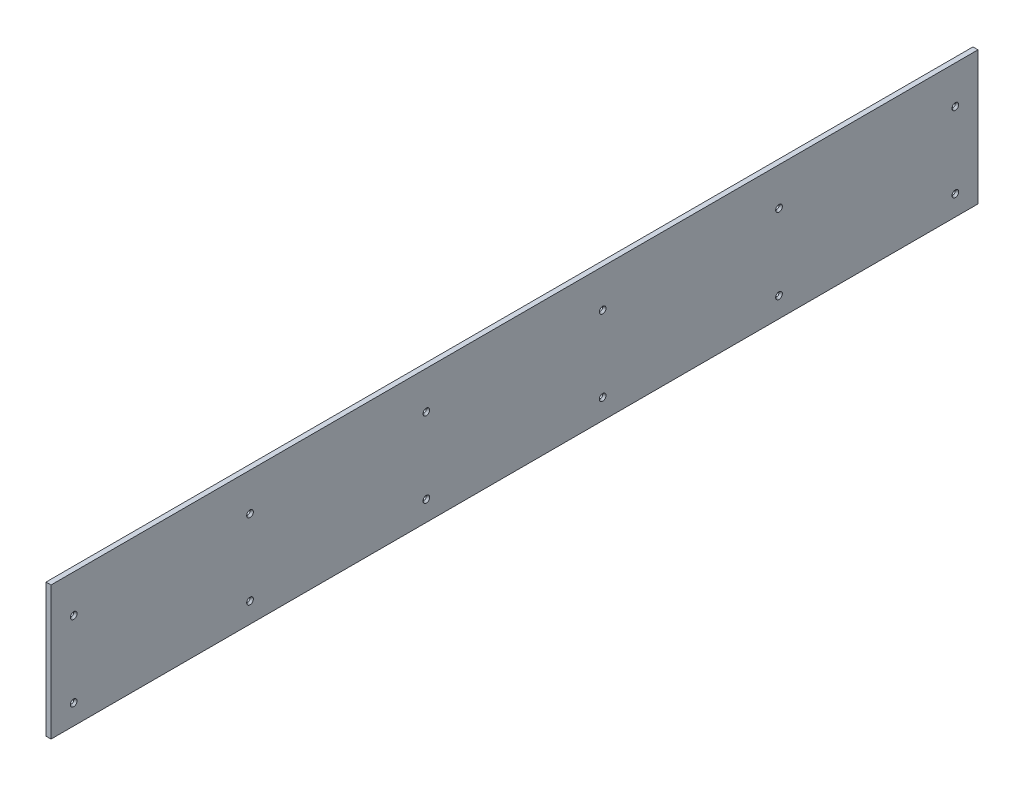
ISO-10303-21;
HEADER;
FILE_DESCRIPTION(('STEP AP214'),'2;1');
FILE_NAME('part.step','',(''),(''),'','','');
FILE_SCHEMA(('AUTOMOTIVE_DESIGN { 1 0 10303 214 1 1 1 1 }'));
ENDSEC;
DATA;
#1=APPLICATION_CONTEXT('core data for automotive mechanical design processes');
#2=APPLICATION_PROTOCOL_DEFINITION('international standard','automotive_design',2000,#1);
#3=PRODUCT_CONTEXT('',#1,'mechanical');
#4=PRODUCT('Part','Part','',(#3));
#5=PRODUCT_RELATED_PRODUCT_CATEGORY('part','',(#4));
#6=PRODUCT_DEFINITION_FORMATION('','',#4);
#7=PRODUCT_DEFINITION_CONTEXT('part definition',#1,'design');
#8=PRODUCT_DEFINITION('design','',#6,#7);
#9=PRODUCT_DEFINITION_SHAPE('','',#8);
#10=(LENGTH_UNIT() NAMED_UNIT(*) SI_UNIT(.MILLI.,.METRE.));
#11=(NAMED_UNIT(*) PLANE_ANGLE_UNIT() SI_UNIT($,.RADIAN.));
#12=(NAMED_UNIT(*) SI_UNIT($,.STERADIAN.) SOLID_ANGLE_UNIT());
#13=UNCERTAINTY_MEASURE_WITH_UNIT(LENGTH_MEASURE(1.E-05),#10,'distance_accuracy_value','');
#14=(GEOMETRIC_REPRESENTATION_CONTEXT(3) GLOBAL_UNCERTAINTY_ASSIGNED_CONTEXT((#13)) GLOBAL_UNIT_ASSIGNED_CONTEXT((#10,
#11,#12)) REPRESENTATION_CONTEXT('',''));
#15=CARTESIAN_POINT('',(0.,0.,0.));
#16=DIRECTION('',(0.,0.,1.));
#17=DIRECTION('',(1.,0.,0.));
#18=AXIS2_PLACEMENT_3D('',#15,#16,#17);
#19=CARTESIAN_POINT('',(6.35,0.,0.));
#20=DIRECTION('',(1.,0.,0.));
#21=DIRECTION('',(0.,0.,-1.));
#22=AXIS2_PLACEMENT_3D('',#19,#20,#21);
#23=PLANE('',#22);
#24=CARTESIAN_POINT('',(6.34999999994079,120.65,-1139.825));
#25=DIRECTION('',(1.,0.,0.));
#26=DIRECTION('',(0.,0.,-1.));
#27=AXIS2_PLACEMENT_3D('',#24,#25,#26);
#28=CIRCLE('',#27,4.21640000004107);
#29=CARTESIAN_POINT('',(6.34999999994079,120.65,-1144.04140000004));
#30=VERTEX_POINT('',#29);
#31=EDGE_CURVE('E74',#30,#30,#28,.F.);
#32=ORIENTED_EDGE('',*,*,#31,.T.);
#33=EDGE_LOOP('',(#32));
#34=FACE_BOUND('',#33,.T.);
#35=CARTESIAN_POINT('',(6.35000000005448,25.4,-1139.825));
#36=DIRECTION('',(1.,0.,0.));
#37=DIRECTION('',(0.,0.,-1.));
#38=AXIS2_PLACEMENT_3D('',#35,#36,#37);
#39=CIRCLE('',#38,4.2164000000279);
#40=CARTESIAN_POINT('',(6.35000000005448,25.4,-1144.04140000003));
#41=VERTEX_POINT('',#40);
#42=EDGE_CURVE('E154',#41,#41,#39,.F.);
#43=ORIENTED_EDGE('',*,*,#42,.T.);
#44=EDGE_LOOP('',(#43));
#45=FACE_BOUND('',#44,.T.);
#46=CARTESIAN_POINT('',(6.34999999994079,120.65,-917.575));
#47=DIRECTION('',(1.,0.,0.));
#48=DIRECTION('',(0.,0.,-1.));
#49=AXIS2_PLACEMENT_3D('',#46,#47,#48);
#50=CIRCLE('',#49,4.21640000004107);
#51=CARTESIAN_POINT('',(6.34999999994079,120.65,-921.791400000041));
#52=VERTEX_POINT('',#51);
#53=EDGE_CURVE('E157',#52,#52,#50,.F.);
#54=ORIENTED_EDGE('',*,*,#53,.T.);
#55=EDGE_LOOP('',(#54));
#56=FACE_BOUND('',#55,.T.);
#57=CARTESIAN_POINT('',(6.35000000005448,25.4,-917.575));
#58=DIRECTION('',(1.,0.,0.));
#59=DIRECTION('',(0.,0.,-1.));
#60=AXIS2_PLACEMENT_3D('',#57,#58,#59);
#61=CIRCLE('',#60,4.2164000000279);
#62=CARTESIAN_POINT('',(6.35000000005448,25.4,-921.791400000028));
#63=VERTEX_POINT('',#62);
#64=EDGE_CURVE('E160',#63,#63,#61,.F.);
#65=ORIENTED_EDGE('',*,*,#64,.T.);
#66=EDGE_LOOP('',(#65));
#67=FACE_BOUND('',#66,.T.);
#68=CARTESIAN_POINT('',(6.34999999994079,120.65,-695.325));
#69=DIRECTION('',(1.,0.,0.));
#70=DIRECTION('',(0.,0.,-1.));
#71=AXIS2_PLACEMENT_3D('',#68,#69,#70);
#72=CIRCLE('',#71,4.21640000004107);
#73=CARTESIAN_POINT('',(6.34999999994079,120.65,-699.541400000041));
#74=VERTEX_POINT('',#73);
#75=EDGE_CURVE('E163',#74,#74,#72,.F.);
#76=ORIENTED_EDGE('',*,*,#75,.T.);
#77=EDGE_LOOP('',(#76));
#78=FACE_BOUND('',#77,.T.);
#79=CARTESIAN_POINT('',(6.35000000005448,25.4,-695.325));
#80=DIRECTION('',(1.,0.,0.));
#81=DIRECTION('',(0.,0.,-1.));
#82=AXIS2_PLACEMENT_3D('',#79,#80,#81);
#83=CIRCLE('',#82,4.2164000000279);
#84=CARTESIAN_POINT('',(6.35000000005448,25.4,-699.541400000028));
#85=VERTEX_POINT('',#84);
#86=EDGE_CURVE('E166',#85,#85,#83,.F.);
#87=ORIENTED_EDGE('',*,*,#86,.T.);
#88=EDGE_LOOP('',(#87));
#89=FACE_BOUND('',#88,.T.);
#90=CARTESIAN_POINT('',(6.34999999994079,120.65,-473.075));
#91=DIRECTION('',(1.,0.,0.));
#92=DIRECTION('',(0.,0.,-1.));
#93=AXIS2_PLACEMENT_3D('',#90,#91,#92);
#94=CIRCLE('',#93,4.21640000004107);
#95=CARTESIAN_POINT('',(6.34999999994079,120.65,-477.291400000041));
#96=VERTEX_POINT('',#95);
#97=EDGE_CURVE('E169',#96,#96,#94,.F.);
#98=ORIENTED_EDGE('',*,*,#97,.T.);
#99=EDGE_LOOP('',(#98));
#100=FACE_BOUND('',#99,.T.);
#101=CARTESIAN_POINT('',(6.35000000005448,25.4,-473.075));
#102=DIRECTION('',(1.,0.,0.));
#103=DIRECTION('',(0.,0.,-1.));
#104=AXIS2_PLACEMENT_3D('',#101,#102,#103);
#105=CIRCLE('',#104,4.2164000000279);
#106=CARTESIAN_POINT('',(6.35000000005448,25.4,-477.291400000028));
#107=VERTEX_POINT('',#106);
#108=EDGE_CURVE('E172',#107,#107,#105,.F.);
#109=ORIENTED_EDGE('',*,*,#108,.T.);
#110=EDGE_LOOP('',(#109));
#111=FACE_BOUND('',#110,.T.);
#112=CARTESIAN_POINT('',(6.34999999994079,120.65,-250.825));
#113=DIRECTION('',(1.,0.,0.));
#114=DIRECTION('',(0.,0.,-1.));
#115=AXIS2_PLACEMENT_3D('',#112,#113,#114);
#116=CIRCLE('',#115,4.21640000004107);
#117=CARTESIAN_POINT('',(6.34999999994079,120.65,-255.041400000041));
#118=VERTEX_POINT('',#117);
#119=EDGE_CURVE('E175',#118,#118,#116,.F.);
#120=ORIENTED_EDGE('',*,*,#119,.T.);
#121=EDGE_LOOP('',(#120));
#122=FACE_BOUND('',#121,.T.);
#123=CARTESIAN_POINT('',(6.35000000005448,25.4,-250.825));
#124=DIRECTION('',(1.,0.,0.));
#125=DIRECTION('',(0.,0.,-1.));
#126=AXIS2_PLACEMENT_3D('',#123,#124,#125);
#127=CIRCLE('',#126,4.2164000000279);
#128=CARTESIAN_POINT('',(6.35000000005448,25.4,-255.041400000028));
#129=VERTEX_POINT('',#128);
#130=EDGE_CURVE('E178',#129,#129,#127,.F.);
#131=ORIENTED_EDGE('',*,*,#130,.T.);
#132=EDGE_LOOP('',(#131));
#133=FACE_BOUND('',#132,.T.);
#134=CARTESIAN_POINT('',(6.34999999994079,120.65,-28.575));
#135=DIRECTION('',(1.,0.,0.));
#136=DIRECTION('',(0.,0.,-1.));
#137=AXIS2_PLACEMENT_3D('',#134,#135,#136);
#138=CIRCLE('',#137,4.21640000004107);
#139=CARTESIAN_POINT('',(6.34999999994079,120.65,-32.7914000000411));
#140=VERTEX_POINT('',#139);
#141=EDGE_CURVE('E180',#140,#140,#138,.F.);
#142=ORIENTED_EDGE('',*,*,#141,.T.);
#143=EDGE_LOOP('',(#142));
#144=FACE_BOUND('',#143,.T.);
#145=CARTESIAN_POINT('',(6.35000000005448,25.4,-28.575));
#146=DIRECTION('',(1.,0.,0.));
#147=DIRECTION('',(0.,0.,-1.));
#148=AXIS2_PLACEMENT_3D('',#145,#146,#147);
#149=CIRCLE('',#148,4.2164000000279);
#150=CARTESIAN_POINT('',(6.35000000005448,25.4,-32.7914000000279));
#151=VERTEX_POINT('',#150);
#152=EDGE_CURVE('E19',#151,#151,#149,.F.);
#153=ORIENTED_EDGE('',*,*,#152,.T.);
#154=EDGE_LOOP('',(#153));
#155=FACE_BOUND('',#154,.T.);
#156=DIRECTION('',(0.,1.,0.));
#157=VECTOR('',#156,1.);
#158=CARTESIAN_POINT('',(6.35,168.275,0.));
#159=LINE('',#158,#157);
#160=CARTESIAN_POINT('',(6.35,0.,0.));
#161=VERTEX_POINT('',#160);
#162=CARTESIAN_POINT('',(6.35,168.275,0.));
#163=VERTEX_POINT('',#162);
#164=EDGE_CURVE('E70',#161,#163,#159,.T.);
#165=ORIENTED_EDGE('',*,*,#164,.F.);
#166=DIRECTION('',(0.,0.,-1.));
#167=VECTOR('',#166,1.);
#168=CARTESIAN_POINT('',(6.35,0.,0.));
#169=LINE('',#168,#167);
#170=CARTESIAN_POINT('',(6.35,0.,-1168.4));
#171=VERTEX_POINT('',#170);
#172=EDGE_CURVE('E67',#171,#161,#169,.F.);
#173=ORIENTED_EDGE('',*,*,#172,.F.);
#174=DIRECTION('',(0.,1.,0.));
#175=VECTOR('',#174,1.);
#176=CARTESIAN_POINT('',(6.35,0.,-1168.4));
#177=LINE('',#176,#175);
#178=CARTESIAN_POINT('',(6.35,168.275,-1168.4));
#179=VERTEX_POINT('',#178);
#180=EDGE_CURVE('E58',#179,#171,#177,.F.);
#181=ORIENTED_EDGE('',*,*,#180,.F.);
#182=DIRECTION('',(0.,0.,1.));
#183=VECTOR('',#182,1.);
#184=CARTESIAN_POINT('',(6.35,168.275,-1168.4));
#185=LINE('',#184,#183);
#186=EDGE_CURVE('E53',#163,#179,#185,.F.);
#187=ORIENTED_EDGE('',*,*,#186,.F.);
#188=EDGE_LOOP('',(#165,#173,#181,#187));
#189=FACE_BOUND('',#188,.T.);
#190=ADVANCED_FACE('F16',(#34,#45,#56,#67,#78,#89,#100,#111,#122,#133,#144,#155,#189),#23,.T.);
#191=CARTESIAN_POINT('',(6.35000000005448,25.4,-28.575));
#192=DIRECTION('',(1.,0.,0.));
#193=DIRECTION('',(0.,0.,-1.));
#194=AXIS2_PLACEMENT_3D('',#191,#192,#193);
#195=CONICAL_SURFACE('',#194,4.2164000000279,0.715584993313268);
#196=CARTESIAN_POINT('',(3.97592719959782,25.4,-28.575));
#197=DIRECTION('',(1.,0.,0.));
#198=DIRECTION('',(0.,0.,-1.));
#199=AXIS2_PLACEMENT_3D('',#196,#197,#198);
#200=CIRCLE('',#199,2.15265);
#201=CARTESIAN_POINT('',(3.97592719959782,25.4,-30.72765));
#202=VERTEX_POINT('',#201);
#203=EDGE_CURVE('E116',#202,#202,#200,.F.);
#204=ORIENTED_EDGE('',*,*,#203,.T.);
#205=EDGE_LOOP('',(#204));
#206=FACE_BOUND('',#205,.T.);
#207=ORIENTED_EDGE('',*,*,#152,.F.);
#208=EDGE_LOOP('',(#207));
#209=FACE_BOUND('',#208,.T.);
#210=ADVANCED_FACE('F188',(#206,#209),#195,.F.);
#211=CARTESIAN_POINT('',(6.34999999977026,120.65,-28.575));
#212=DIRECTION('',(1.,0.,0.));
#213=DIRECTION('',(0.,0.,-1.));
#214=AXIS2_PLACEMENT_3D('',#211,#212,#213);
#215=CONICAL_SURFACE('',#214,4.21639999989283,0.715584993333413);
#216=CARTESIAN_POINT('',(3.97592719959782,120.65,-28.575));
#217=DIRECTION('',(1.,0.,0.));
#218=DIRECTION('',(0.,0.,-1.));
#219=AXIS2_PLACEMENT_3D('',#216,#217,#218);
#220=CIRCLE('',#219,2.15265);
#221=CARTESIAN_POINT('',(3.97592719959782,120.65,-30.72765));
#222=VERTEX_POINT('',#221);
#223=EDGE_CURVE('E113',#222,#222,#220,.F.);
#224=ORIENTED_EDGE('',*,*,#223,.T.);
#225=EDGE_LOOP('',(#224));
#226=FACE_BOUND('',#225,.T.);
#227=ORIENTED_EDGE('',*,*,#141,.F.);
#228=EDGE_LOOP('',(#227));
#229=FACE_BOUND('',#228,.T.);
#230=ADVANCED_FACE('F190',(#226,#229),#215,.F.);
#231=CARTESIAN_POINT('',(6.35000000005448,25.4,-250.825));
#232=DIRECTION('',(1.,0.,0.));
#233=DIRECTION('',(0.,0.,-1.));
#234=AXIS2_PLACEMENT_3D('',#231,#232,#233);
#235=CONICAL_SURFACE('',#234,4.2164000000279,0.715584993313268);
#236=CARTESIAN_POINT('',(3.97592719959782,25.4,-250.825));
#237=DIRECTION('',(1.,0.,0.));
#238=DIRECTION('',(0.,0.,-1.));
#239=AXIS2_PLACEMENT_3D('',#236,#237,#238);
#240=CIRCLE('',#239,2.15265);
#241=CARTESIAN_POINT('',(3.97592719959782,25.4,-252.97765));
#242=VERTEX_POINT('',#241);
#243=EDGE_CURVE('E110',#242,#242,#240,.F.);
#244=ORIENTED_EDGE('',*,*,#243,.T.);
#245=EDGE_LOOP('',(#244));
#246=FACE_BOUND('',#245,.T.);
#247=ORIENTED_EDGE('',*,*,#130,.F.);
#248=EDGE_LOOP('',(#247));
#249=FACE_BOUND('',#248,.T.);
#250=ADVANCED_FACE('F197',(#246,#249),#235,.F.);
#251=CARTESIAN_POINT('',(6.34999999977026,120.65,-250.825));
#252=DIRECTION('',(1.,0.,0.));
#253=DIRECTION('',(0.,0.,-1.));
#254=AXIS2_PLACEMENT_3D('',#251,#252,#253);
#255=CONICAL_SURFACE('',#254,4.21639999989283,0.715584993333413);
#256=CARTESIAN_POINT('',(3.97592719959782,120.65,-250.825));
#257=DIRECTION('',(1.,0.,0.));
#258=DIRECTION('',(0.,0.,-1.));
#259=AXIS2_PLACEMENT_3D('',#256,#257,#258);
#260=CIRCLE('',#259,2.15265);
#261=CARTESIAN_POINT('',(3.97592719959782,120.65,-252.97765));
#262=VERTEX_POINT('',#261);
#263=EDGE_CURVE('E107',#262,#262,#260,.F.);
#264=ORIENTED_EDGE('',*,*,#263,.T.);
#265=EDGE_LOOP('',(#264));
#266=FACE_BOUND('',#265,.T.);
#267=ORIENTED_EDGE('',*,*,#119,.F.);
#268=EDGE_LOOP('',(#267));
#269=FACE_BOUND('',#268,.T.);
#270=ADVANCED_FACE('F299',(#266,#269),#255,.F.);
#271=CARTESIAN_POINT('',(6.35000000005448,25.4,-473.075));
#272=DIRECTION('',(1.,0.,0.));
#273=DIRECTION('',(0.,0.,-1.));
#274=AXIS2_PLACEMENT_3D('',#271,#272,#273);
#275=CONICAL_SURFACE('',#274,4.2164000000279,0.715584993313268);
#276=CARTESIAN_POINT('',(3.97592719959782,25.4,-473.075));
#277=DIRECTION('',(1.,0.,0.));
#278=DIRECTION('',(0.,0.,-1.));
#279=AXIS2_PLACEMENT_3D('',#276,#277,#278);
#280=CIRCLE('',#279,2.15265);
#281=CARTESIAN_POINT('',(3.97592719959782,25.4,-475.22765));
#282=VERTEX_POINT('',#281);
#283=EDGE_CURVE('E104',#282,#282,#280,.F.);
#284=ORIENTED_EDGE('',*,*,#283,.T.);
#285=EDGE_LOOP('',(#284));
#286=FACE_BOUND('',#285,.T.);
#287=ORIENTED_EDGE('',*,*,#108,.F.);
#288=EDGE_LOOP('',(#287));
#289=FACE_BOUND('',#288,.T.);
#290=ADVANCED_FACE('F295',(#286,#289),#275,.F.);
#291=CARTESIAN_POINT('',(6.34999999977026,120.65,-473.075));
#292=DIRECTION('',(1.,0.,0.));
#293=DIRECTION('',(0.,0.,-1.));
#294=AXIS2_PLACEMENT_3D('',#291,#292,#293);
#295=CONICAL_SURFACE('',#294,4.21639999989283,0.715584993333413);
#296=CARTESIAN_POINT('',(3.97592719959782,120.65,-473.075));
#297=DIRECTION('',(1.,0.,0.));
#298=DIRECTION('',(0.,0.,-1.));
#299=AXIS2_PLACEMENT_3D('',#296,#297,#298);
#300=CIRCLE('',#299,2.15265);
#301=CARTESIAN_POINT('',(3.97592719959782,120.65,-475.22765));
#302=VERTEX_POINT('',#301);
#303=EDGE_CURVE('E101',#302,#302,#300,.F.);
#304=ORIENTED_EDGE('',*,*,#303,.T.);
#305=EDGE_LOOP('',(#304));
#306=FACE_BOUND('',#305,.T.);
#307=ORIENTED_EDGE('',*,*,#97,.F.);
#308=EDGE_LOOP('',(#307));
#309=FACE_BOUND('',#308,.T.);
#310=ADVANCED_FACE('F291',(#306,#309),#295,.F.);
#311=CARTESIAN_POINT('',(6.35000000005448,25.4,-695.325));
#312=DIRECTION('',(1.,0.,0.));
#313=DIRECTION('',(0.,0.,-1.));
#314=AXIS2_PLACEMENT_3D('',#311,#312,#313);
#315=CONICAL_SURFACE('',#314,4.2164000000279,0.715584993313268);
#316=CARTESIAN_POINT('',(3.97592719959782,25.4,-695.325));
#317=DIRECTION('',(1.,0.,0.));
#318=DIRECTION('',(0.,0.,-1.));
#319=AXIS2_PLACEMENT_3D('',#316,#317,#318);
#320=CIRCLE('',#319,2.15265);
#321=CARTESIAN_POINT('',(3.97592719959782,25.4,-697.47765));
#322=VERTEX_POINT('',#321);
#323=EDGE_CURVE('E98',#322,#322,#320,.F.);
#324=ORIENTED_EDGE('',*,*,#323,.T.);
#325=EDGE_LOOP('',(#324));
#326=FACE_BOUND('',#325,.T.);
#327=ORIENTED_EDGE('',*,*,#86,.F.);
#328=EDGE_LOOP('',(#327));
#329=FACE_BOUND('',#328,.T.);
#330=ADVANCED_FACE('F287',(#326,#329),#315,.F.);
#331=CARTESIAN_POINT('',(6.34999999977026,120.65,-695.325));
#332=DIRECTION('',(1.,0.,0.));
#333=DIRECTION('',(0.,0.,-1.));
#334=AXIS2_PLACEMENT_3D('',#331,#332,#333);
#335=CONICAL_SURFACE('',#334,4.21639999989283,0.715584993333413);
#336=CARTESIAN_POINT('',(3.97592719959782,120.65,-695.325));
#337=DIRECTION('',(1.,0.,0.));
#338=DIRECTION('',(0.,0.,-1.));
#339=AXIS2_PLACEMENT_3D('',#336,#337,#338);
#340=CIRCLE('',#339,2.15265);
#341=CARTESIAN_POINT('',(3.97592719959782,120.65,-697.47765));
#342=VERTEX_POINT('',#341);
#343=EDGE_CURVE('E95',#342,#342,#340,.F.);
#344=ORIENTED_EDGE('',*,*,#343,.T.);
#345=EDGE_LOOP('',(#344));
#346=FACE_BOUND('',#345,.T.);
#347=ORIENTED_EDGE('',*,*,#75,.F.);
#348=EDGE_LOOP('',(#347));
#349=FACE_BOUND('',#348,.T.);
#350=ADVANCED_FACE('F283',(#346,#349),#335,.F.);
#351=CARTESIAN_POINT('',(6.35000000005448,25.4,-917.575));
#352=DIRECTION('',(1.,0.,0.));
#353=DIRECTION('',(0.,0.,-1.));
#354=AXIS2_PLACEMENT_3D('',#351,#352,#353);
#355=CONICAL_SURFACE('',#354,4.2164000000279,0.715584993313268);
#356=CARTESIAN_POINT('',(3.97592719959782,25.4,-917.575));
#357=DIRECTION('',(1.,0.,0.));
#358=DIRECTION('',(0.,0.,-1.));
#359=AXIS2_PLACEMENT_3D('',#356,#357,#358);
#360=CIRCLE('',#359,2.15265);
#361=CARTESIAN_POINT('',(3.97592719959782,25.4,-919.72765));
#362=VERTEX_POINT('',#361);
#363=EDGE_CURVE('E92',#362,#362,#360,.F.);
#364=ORIENTED_EDGE('',*,*,#363,.T.);
#365=EDGE_LOOP('',(#364));
#366=FACE_BOUND('',#365,.T.);
#367=ORIENTED_EDGE('',*,*,#64,.F.);
#368=EDGE_LOOP('',(#367));
#369=FACE_BOUND('',#368,.T.);
#370=ADVANCED_FACE('F279',(#366,#369),#355,.F.);
#371=CARTESIAN_POINT('',(6.34999999977026,120.65,-917.575));
#372=DIRECTION('',(1.,0.,0.));
#373=DIRECTION('',(0.,0.,-1.));
#374=AXIS2_PLACEMENT_3D('',#371,#372,#373);
#375=CONICAL_SURFACE('',#374,4.21639999989283,0.715584993333413);
#376=CARTESIAN_POINT('',(3.97592719959782,120.65,-917.575));
#377=DIRECTION('',(1.,0.,0.));
#378=DIRECTION('',(0.,0.,-1.));
#379=AXIS2_PLACEMENT_3D('',#376,#377,#378);
#380=CIRCLE('',#379,2.15265);
#381=CARTESIAN_POINT('',(3.97592719959782,120.65,-919.72765));
#382=VERTEX_POINT('',#381);
#383=EDGE_CURVE('E89',#382,#382,#380,.F.);
#384=ORIENTED_EDGE('',*,*,#383,.T.);
#385=EDGE_LOOP('',(#384));
#386=FACE_BOUND('',#385,.T.);
#387=ORIENTED_EDGE('',*,*,#53,.F.);
#388=EDGE_LOOP('',(#387));
#389=FACE_BOUND('',#388,.T.);
#390=ADVANCED_FACE('F275',(#386,#389),#375,.F.);
#391=CARTESIAN_POINT('',(6.35000000005448,25.4,-1139.825));
#392=DIRECTION('',(1.,0.,0.));
#393=DIRECTION('',(0.,0.,-1.));
#394=AXIS2_PLACEMENT_3D('',#391,#392,#393);
#395=CONICAL_SURFACE('',#394,4.2164000000279,0.715584993313268);
#396=CARTESIAN_POINT('',(3.97592719959782,25.4,-1139.825));
#397=DIRECTION('',(1.,0.,0.));
#398=DIRECTION('',(0.,0.,-1.));
#399=AXIS2_PLACEMENT_3D('',#396,#397,#398);
#400=CIRCLE('',#399,2.15265);
#401=CARTESIAN_POINT('',(3.97592719959782,25.4,-1141.97765));
#402=VERTEX_POINT('',#401);
#403=EDGE_CURVE('E86',#402,#402,#400,.F.);
#404=ORIENTED_EDGE('',*,*,#403,.T.);
#405=EDGE_LOOP('',(#404));
#406=FACE_BOUND('',#405,.T.);
#407=ORIENTED_EDGE('',*,*,#42,.F.);
#408=EDGE_LOOP('',(#407));
#409=FACE_BOUND('',#408,.T.);
#410=ADVANCED_FACE('F271',(#406,#409),#395,.F.);
#411=CARTESIAN_POINT('',(6.34999999977026,120.65,-1139.825));
#412=DIRECTION('',(1.,0.,0.));
#413=DIRECTION('',(0.,0.,-1.));
#414=AXIS2_PLACEMENT_3D('',#411,#412,#413);
#415=CONICAL_SURFACE('',#414,4.21639999989283,0.715584993333413);
#416=CARTESIAN_POINT('',(3.97592719959782,120.65,-1139.825));
#417=DIRECTION('',(1.,0.,0.));
#418=DIRECTION('',(0.,0.,-1.));
#419=AXIS2_PLACEMENT_3D('',#416,#417,#418);
#420=CIRCLE('',#419,2.15265);
#421=CARTESIAN_POINT('',(3.97592719959782,120.65,-1141.97765));
#422=VERTEX_POINT('',#421);
#423=EDGE_CURVE('E83',#422,#422,#420,.F.);
#424=ORIENTED_EDGE('',*,*,#423,.T.);
#425=EDGE_LOOP('',(#424));
#426=FACE_BOUND('',#425,.T.);
#427=ORIENTED_EDGE('',*,*,#31,.F.);
#428=EDGE_LOOP('',(#427));
#429=FACE_BOUND('',#428,.T.);
#430=ADVANCED_FACE('F268',(#426,#429),#415,.F.);
#431=CARTESIAN_POINT('',(0.,0.,0.));
#432=DIRECTION('',(0.,-1.,0.));
#433=DIRECTION('',(0.,0.,-1.));
#434=AXIS2_PLACEMENT_3D('',#431,#432,#433);
#435=PLANE('',#434);
#436=DIRECTION('',(1.,0.,0.));
#437=VECTOR('',#436,1.);
#438=CARTESIAN_POINT('',(0.,0.,0.));
#439=LINE('',#438,#437);
#440=CARTESIAN_POINT('',(0.,0.,0.));
#441=VERTEX_POINT('',#440);
#442=EDGE_CURVE('E331',#441,#161,#439,.T.);
#443=ORIENTED_EDGE('',*,*,#442,.F.);
#444=DIRECTION('',(0.,0.,-1.));
#445=VECTOR('',#444,1.);
#446=CARTESIAN_POINT('',(0.,0.,0.));
#447=LINE('',#446,#445);
#448=CARTESIAN_POINT('',(0.,0.,-1168.4));
#449=VERTEX_POINT('',#448);
#450=EDGE_CURVE('E78',#441,#449,#447,.T.);
#451=ORIENTED_EDGE('',*,*,#450,.T.);
#452=DIRECTION('',(-1.,0.,0.));
#453=VECTOR('',#452,1.);
#454=CARTESIAN_POINT('',(0.,0.,-1168.4));
#455=LINE('',#454,#453);
#456=EDGE_CURVE('E63',#171,#449,#455,.T.);
#457=ORIENTED_EDGE('',*,*,#456,.F.);
#458=ORIENTED_EDGE('',*,*,#172,.T.);
#459=EDGE_LOOP('',(#443,#451,#457,#458));
#460=FACE_BOUND('',#459,.T.);
#461=ADVANCED_FACE('F77',(#460),#435,.T.);
#462=CARTESIAN_POINT('',(0.,0.,-1168.4));
#463=DIRECTION('',(0.,0.,-1.));
#464=DIRECTION('',(-1.,0.,0.));
#465=AXIS2_PLACEMENT_3D('',#462,#463,#464);
#466=PLANE('',#465);
#467=ORIENTED_EDGE('',*,*,#456,.T.);
#468=DIRECTION('',(0.,1.,0.));
#469=VECTOR('',#468,1.);
#470=CARTESIAN_POINT('',(0.,0.,-1168.4));
#471=LINE('',#470,#469);
#472=CARTESIAN_POINT('',(0.,168.275,-1168.4));
#473=VERTEX_POINT('',#472);
#474=EDGE_CURVE('E323',#449,#473,#471,.T.);
#475=ORIENTED_EDGE('',*,*,#474,.T.);
#476=DIRECTION('',(1.,0.,0.));
#477=VECTOR('',#476,1.);
#478=CARTESIAN_POINT('',(0.,168.275,-1168.4));
#479=LINE('',#478,#477);
#480=EDGE_CURVE('E65',#179,#473,#479,.F.);
#481=ORIENTED_EDGE('',*,*,#480,.F.);
#482=ORIENTED_EDGE('',*,*,#180,.T.);
#483=EDGE_LOOP('',(#467,#475,#481,#482));
#484=FACE_BOUND('',#483,.T.);
#485=ADVANCED_FACE('F60',(#484),#466,.T.);
#486=CARTESIAN_POINT('',(0.,168.275,-1168.4));
#487=DIRECTION('',(0.,1.,0.));
#488=DIRECTION('',(0.,0.,1.));
#489=AXIS2_PLACEMENT_3D('',#486,#487,#488);
#490=PLANE('',#489);
#491=ORIENTED_EDGE('',*,*,#480,.T.);
#492=DIRECTION('',(0.,0.,-1.));
#493=VECTOR('',#492,1.);
#494=CARTESIAN_POINT('',(0.,168.275,0.));
#495=LINE('',#494,#493);
#496=CARTESIAN_POINT('',(0.,168.275,0.));
#497=VERTEX_POINT('',#496);
#498=EDGE_CURVE('E322',#473,#497,#495,.F.);
#499=ORIENTED_EDGE('',*,*,#498,.T.);
#500=DIRECTION('',(1.,0.,0.));
#501=VECTOR('',#500,1.);
#502=CARTESIAN_POINT('',(0.,168.275,0.));
#503=LINE('',#502,#501);
#504=EDGE_CURVE('E34',#163,#497,#503,.F.);
#505=ORIENTED_EDGE('',*,*,#504,.F.);
#506=ORIENTED_EDGE('',*,*,#186,.T.);
#507=EDGE_LOOP('',(#491,#499,#505,#506));
#508=FACE_BOUND('',#507,.T.);
#509=ADVANCED_FACE('F261',(#508),#490,.T.);
#510=CARTESIAN_POINT('',(0.,168.275,0.));
#511=DIRECTION('',(0.,0.,1.));
#512=DIRECTION('',(1.,0.,0.));
#513=AXIS2_PLACEMENT_3D('',#510,#511,#512);
#514=PLANE('',#513);
#515=ORIENTED_EDGE('',*,*,#504,.T.);
#516=DIRECTION('',(0.,1.,0.));
#517=VECTOR('',#516,1.);
#518=CARTESIAN_POINT('',(0.,0.,0.));
#519=LINE('',#518,#517);
#520=EDGE_CURVE('E151',#497,#441,#519,.F.);
#521=ORIENTED_EDGE('',*,*,#520,.T.);
#522=ORIENTED_EDGE('',*,*,#442,.T.);
#523=ORIENTED_EDGE('',*,*,#164,.T.);
#524=EDGE_LOOP('',(#515,#521,#522,#523));
#525=FACE_BOUND('',#524,.T.);
#526=ADVANCED_FACE('F257',(#525),#514,.T.);
#527=CARTESIAN_POINT('',(-1.55694656066174,25.4,-28.575));
#528=DIRECTION('',(1.,0.,0.));
#529=DIRECTION('',(0.,0.,-1.));
#530=AXIS2_PLACEMENT_3D('',#527,#528,#529);
#531=CYLINDRICAL_SURFACE('',#530,2.15265);
#532=ORIENTED_EDGE('',*,*,#203,.F.);
#533=EDGE_LOOP('',(#532));
#534=FACE_BOUND('',#533,.T.);
#535=CARTESIAN_POINT('',(0.,25.4,-28.575));
#536=DIRECTION('',(1.,0.,0.));
#537=DIRECTION('',(0.,0.,-1.));
#538=AXIS2_PLACEMENT_3D('',#535,#536,#537);
#539=CIRCLE('',#538,2.15265);
#540=CARTESIAN_POINT('',(0.,25.4,-30.72765));
#541=VERTEX_POINT('',#540);
#542=EDGE_CURVE('E148',#541,#541,#539,.F.);
#543=ORIENTED_EDGE('',*,*,#542,.T.);
#544=EDGE_LOOP('',(#543));
#545=FACE_BOUND('',#544,.T.);
#546=ADVANCED_FACE('F253',(#534,#545),#531,.F.);
#547=CARTESIAN_POINT('',(-1.55694656066174,120.65,-28.575));
#548=DIRECTION('',(1.,0.,0.));
#549=DIRECTION('',(0.,0.,-1.));
#550=AXIS2_PLACEMENT_3D('',#547,#548,#549);
#551=CYLINDRICAL_SURFACE('',#550,2.15265);
#552=ORIENTED_EDGE('',*,*,#223,.F.);
#553=EDGE_LOOP('',(#552));
#554=FACE_BOUND('',#553,.T.);
#555=CARTESIAN_POINT('',(0.,120.65,-28.575));
#556=DIRECTION('',(1.,0.,0.));
#557=DIRECTION('',(0.,0.,-1.));
#558=AXIS2_PLACEMENT_3D('',#555,#556,#557);
#559=CIRCLE('',#558,2.15265);
#560=CARTESIAN_POINT('',(0.,120.65,-30.72765));
#561=VERTEX_POINT('',#560);
#562=EDGE_CURVE('E145',#561,#561,#559,.F.);
#563=ORIENTED_EDGE('',*,*,#562,.T.);
#564=EDGE_LOOP('',(#563));
#565=FACE_BOUND('',#564,.T.);
#566=ADVANCED_FACE('F249',(#554,#565),#551,.F.);
#567=CARTESIAN_POINT('',(-1.55694656066174,25.4,-250.825));
#568=DIRECTION('',(1.,0.,0.));
#569=DIRECTION('',(0.,0.,-1.));
#570=AXIS2_PLACEMENT_3D('',#567,#568,#569);
#571=CYLINDRICAL_SURFACE('',#570,2.15265);
#572=ORIENTED_EDGE('',*,*,#243,.F.);
#573=EDGE_LOOP('',(#572));
#574=FACE_BOUND('',#573,.T.);
#575=CARTESIAN_POINT('',(0.,25.4,-250.825));
#576=DIRECTION('',(1.,0.,0.));
#577=DIRECTION('',(0.,0.,-1.));
#578=AXIS2_PLACEMENT_3D('',#575,#576,#577);
#579=CIRCLE('',#578,2.15265);
#580=CARTESIAN_POINT('',(0.,25.4,-252.97765));
#581=VERTEX_POINT('',#580);
#582=EDGE_CURVE('E142',#581,#581,#579,.F.);
#583=ORIENTED_EDGE('',*,*,#582,.T.);
#584=EDGE_LOOP('',(#583));
#585=FACE_BOUND('',#584,.T.);
#586=ADVANCED_FACE('F245',(#574,#585),#571,.F.);
#587=CARTESIAN_POINT('',(-1.55694656066174,120.65,-250.825));
#588=DIRECTION('',(1.,0.,0.));
#589=DIRECTION('',(0.,0.,-1.));
#590=AXIS2_PLACEMENT_3D('',#587,#588,#589);
#591=CYLINDRICAL_SURFACE('',#590,2.15265);
#592=ORIENTED_EDGE('',*,*,#263,.F.);
#593=EDGE_LOOP('',(#592));
#594=FACE_BOUND('',#593,.T.);
#595=CARTESIAN_POINT('',(0.,120.65,-250.825));
#596=DIRECTION('',(1.,0.,0.));
#597=DIRECTION('',(0.,0.,-1.));
#598=AXIS2_PLACEMENT_3D('',#595,#596,#597);
#599=CIRCLE('',#598,2.15265);
#600=CARTESIAN_POINT('',(0.,120.65,-252.97765));
#601=VERTEX_POINT('',#600);
#602=EDGE_CURVE('E139',#601,#601,#599,.F.);
#603=ORIENTED_EDGE('',*,*,#602,.T.);
#604=EDGE_LOOP('',(#603));
#605=FACE_BOUND('',#604,.T.);
#606=ADVANCED_FACE('F241',(#594,#605),#591,.F.);
#607=CARTESIAN_POINT('',(-1.55694656066174,25.4,-473.075));
#608=DIRECTION('',(1.,0.,0.));
#609=DIRECTION('',(0.,0.,-1.));
#610=AXIS2_PLACEMENT_3D('',#607,#608,#609);
#611=CYLINDRICAL_SURFACE('',#610,2.15265);
#612=ORIENTED_EDGE('',*,*,#283,.F.);
#613=EDGE_LOOP('',(#612));
#614=FACE_BOUND('',#613,.T.);
#615=CARTESIAN_POINT('',(0.,25.4,-473.075));
#616=DIRECTION('',(1.,0.,0.));
#617=DIRECTION('',(0.,0.,-1.));
#618=AXIS2_PLACEMENT_3D('',#615,#616,#617);
#619=CIRCLE('',#618,2.15265);
#620=CARTESIAN_POINT('',(0.,25.4,-475.22765));
#621=VERTEX_POINT('',#620);
#622=EDGE_CURVE('E136',#621,#621,#619,.F.);
#623=ORIENTED_EDGE('',*,*,#622,.T.);
#624=EDGE_LOOP('',(#623));
#625=FACE_BOUND('',#624,.T.);
#626=ADVANCED_FACE('F237',(#614,#625),#611,.F.);
#627=CARTESIAN_POINT('',(-1.55694656066174,120.65,-473.075));
#628=DIRECTION('',(1.,0.,0.));
#629=DIRECTION('',(0.,0.,-1.));
#630=AXIS2_PLACEMENT_3D('',#627,#628,#629);
#631=CYLINDRICAL_SURFACE('',#630,2.15265);
#632=ORIENTED_EDGE('',*,*,#303,.F.);
#633=EDGE_LOOP('',(#632));
#634=FACE_BOUND('',#633,.T.);
#635=CARTESIAN_POINT('',(0.,120.65,-473.075));
#636=DIRECTION('',(1.,0.,0.));
#637=DIRECTION('',(0.,0.,-1.));
#638=AXIS2_PLACEMENT_3D('',#635,#636,#637);
#639=CIRCLE('',#638,2.15265);
#640=CARTESIAN_POINT('',(0.,120.65,-475.22765));
#641=VERTEX_POINT('',#640);
#642=EDGE_CURVE('E133',#641,#641,#639,.F.);
#643=ORIENTED_EDGE('',*,*,#642,.T.);
#644=EDGE_LOOP('',(#643));
#645=FACE_BOUND('',#644,.T.);
#646=ADVANCED_FACE('F233',(#634,#645),#631,.F.);
#647=CARTESIAN_POINT('',(-1.55694656066174,25.4,-695.325));
#648=DIRECTION('',(1.,0.,0.));
#649=DIRECTION('',(0.,0.,-1.));
#650=AXIS2_PLACEMENT_3D('',#647,#648,#649);
#651=CYLINDRICAL_SURFACE('',#650,2.15265);
#652=ORIENTED_EDGE('',*,*,#323,.F.);
#653=EDGE_LOOP('',(#652));
#654=FACE_BOUND('',#653,.T.);
#655=CARTESIAN_POINT('',(0.,25.4,-695.325));
#656=DIRECTION('',(1.,0.,0.));
#657=DIRECTION('',(0.,0.,-1.));
#658=AXIS2_PLACEMENT_3D('',#655,#656,#657);
#659=CIRCLE('',#658,2.15265);
#660=CARTESIAN_POINT('',(0.,25.4,-697.47765));
#661=VERTEX_POINT('',#660);
#662=EDGE_CURVE('E130',#661,#661,#659,.F.);
#663=ORIENTED_EDGE('',*,*,#662,.T.);
#664=EDGE_LOOP('',(#663));
#665=FACE_BOUND('',#664,.T.);
#666=ADVANCED_FACE('F229',(#654,#665),#651,.F.);
#667=CARTESIAN_POINT('',(-1.55694656066174,120.65,-695.325));
#668=DIRECTION('',(1.,0.,0.));
#669=DIRECTION('',(0.,0.,-1.));
#670=AXIS2_PLACEMENT_3D('',#667,#668,#669);
#671=CYLINDRICAL_SURFACE('',#670,2.15265);
#672=ORIENTED_EDGE('',*,*,#343,.F.);
#673=EDGE_LOOP('',(#672));
#674=FACE_BOUND('',#673,.T.);
#675=CARTESIAN_POINT('',(0.,120.65,-695.325));
#676=DIRECTION('',(1.,0.,0.));
#677=DIRECTION('',(0.,0.,-1.));
#678=AXIS2_PLACEMENT_3D('',#675,#676,#677);
#679=CIRCLE('',#678,2.15265);
#680=CARTESIAN_POINT('',(0.,120.65,-697.47765));
#681=VERTEX_POINT('',#680);
#682=EDGE_CURVE('E127',#681,#681,#679,.F.);
#683=ORIENTED_EDGE('',*,*,#682,.T.);
#684=EDGE_LOOP('',(#683));
#685=FACE_BOUND('',#684,.T.);
#686=ADVANCED_FACE('F225',(#674,#685),#671,.F.);
#687=CARTESIAN_POINT('',(-1.55694656066174,25.4,-917.575));
#688=DIRECTION('',(1.,0.,0.));
#689=DIRECTION('',(0.,0.,-1.));
#690=AXIS2_PLACEMENT_3D('',#687,#688,#689);
#691=CYLINDRICAL_SURFACE('',#690,2.15265);
#692=ORIENTED_EDGE('',*,*,#363,.F.);
#693=EDGE_LOOP('',(#692));
#694=FACE_BOUND('',#693,.T.);
#695=CARTESIAN_POINT('',(0.,25.4,-917.575));
#696=DIRECTION('',(1.,0.,0.));
#697=DIRECTION('',(0.,0.,-1.));
#698=AXIS2_PLACEMENT_3D('',#695,#696,#697);
#699=CIRCLE('',#698,2.15265);
#700=CARTESIAN_POINT('',(0.,25.4,-919.72765));
#701=VERTEX_POINT('',#700);
#702=EDGE_CURVE('E124',#701,#701,#699,.F.);
#703=ORIENTED_EDGE('',*,*,#702,.T.);
#704=EDGE_LOOP('',(#703));
#705=FACE_BOUND('',#704,.T.);
#706=ADVANCED_FACE('F221',(#694,#705),#691,.F.);
#707=CARTESIAN_POINT('',(-1.55694656066174,120.65,-917.575));
#708=DIRECTION('',(1.,0.,0.));
#709=DIRECTION('',(0.,0.,-1.));
#710=AXIS2_PLACEMENT_3D('',#707,#708,#709);
#711=CYLINDRICAL_SURFACE('',#710,2.15265);
#712=ORIENTED_EDGE('',*,*,#383,.F.);
#713=EDGE_LOOP('',(#712));
#714=FACE_BOUND('',#713,.T.);
#715=CARTESIAN_POINT('',(0.,120.65,-917.575));
#716=DIRECTION('',(1.,0.,0.));
#717=DIRECTION('',(0.,0.,-1.));
#718=AXIS2_PLACEMENT_3D('',#715,#716,#717);
#719=CIRCLE('',#718,2.15265);
#720=CARTESIAN_POINT('',(0.,120.65,-919.72765));
#721=VERTEX_POINT('',#720);
#722=EDGE_CURVE('E121',#721,#721,#719,.F.);
#723=ORIENTED_EDGE('',*,*,#722,.T.);
#724=EDGE_LOOP('',(#723));
#725=FACE_BOUND('',#724,.T.);
#726=ADVANCED_FACE('F217',(#714,#725),#711,.F.);
#727=CARTESIAN_POINT('',(-1.55694656066174,25.4,-1139.825));
#728=DIRECTION('',(1.,0.,0.));
#729=DIRECTION('',(0.,0.,-1.));
#730=AXIS2_PLACEMENT_3D('',#727,#728,#729);
#731=CYLINDRICAL_SURFACE('',#730,2.15265);
#732=ORIENTED_EDGE('',*,*,#403,.F.);
#733=EDGE_LOOP('',(#732));
#734=FACE_BOUND('',#733,.T.);
#735=CARTESIAN_POINT('',(0.,25.4,-1139.825));
#736=DIRECTION('',(1.,0.,0.));
#737=DIRECTION('',(0.,0.,-1.));
#738=AXIS2_PLACEMENT_3D('',#735,#736,#737);
#739=CIRCLE('',#738,2.15265);
#740=CARTESIAN_POINT('',(0.,25.4,-1141.97765));
#741=VERTEX_POINT('',#740);
#742=EDGE_CURVE('E25',#741,#741,#739,.F.);
#743=ORIENTED_EDGE('',*,*,#742,.T.);
#744=EDGE_LOOP('',(#743));
#745=FACE_BOUND('',#744,.T.);
#746=ADVANCED_FACE('F209',(#734,#745),#731,.F.);
#747=CARTESIAN_POINT('',(-1.55694656066174,120.65,-1139.825));
#748=DIRECTION('',(1.,0.,0.));
#749=DIRECTION('',(0.,0.,-1.));
#750=AXIS2_PLACEMENT_3D('',#747,#748,#749);
#751=CYLINDRICAL_SURFACE('',#750,2.15265);
#752=ORIENTED_EDGE('',*,*,#423,.F.);
#753=EDGE_LOOP('',(#752));
#754=FACE_BOUND('',#753,.T.);
#755=CARTESIAN_POINT('',(0.,120.65,-1139.825));
#756=DIRECTION('',(1.,0.,0.));
#757=DIRECTION('',(0.,0.,-1.));
#758=AXIS2_PLACEMENT_3D('',#755,#756,#757);
#759=CIRCLE('',#758,2.15265);
#760=CARTESIAN_POINT('',(0.,120.65,-1141.97765));
#761=VERTEX_POINT('',#760);
#762=EDGE_CURVE('E11',#761,#761,#759,.F.);
#763=ORIENTED_EDGE('',*,*,#762,.T.);
#764=EDGE_LOOP('',(#763));
#765=FACE_BOUND('',#764,.T.);
#766=ADVANCED_FACE('F203',(#754,#765),#751,.F.);
#767=CARTESIAN_POINT('',(0.,0.,0.));
#768=DIRECTION('',(1.,0.,0.));
#769=DIRECTION('',(0.,0.,-1.));
#770=AXIS2_PLACEMENT_3D('',#767,#768,#769);
#771=PLANE('',#770);
#772=ORIENTED_EDGE('',*,*,#762,.F.);
#773=EDGE_LOOP('',(#772));
#774=FACE_BOUND('',#773,.T.);
#775=ORIENTED_EDGE('',*,*,#742,.F.);
#776=EDGE_LOOP('',(#775));
#777=FACE_BOUND('',#776,.T.);
#778=ORIENTED_EDGE('',*,*,#722,.F.);
#779=EDGE_LOOP('',(#778));
#780=FACE_BOUND('',#779,.T.);
#781=ORIENTED_EDGE('',*,*,#702,.F.);
#782=EDGE_LOOP('',(#781));
#783=FACE_BOUND('',#782,.T.);
#784=ORIENTED_EDGE('',*,*,#682,.F.);
#785=EDGE_LOOP('',(#784));
#786=FACE_BOUND('',#785,.T.);
#787=ORIENTED_EDGE('',*,*,#662,.F.);
#788=EDGE_LOOP('',(#787));
#789=FACE_BOUND('',#788,.T.);
#790=ORIENTED_EDGE('',*,*,#642,.F.);
#791=EDGE_LOOP('',(#790));
#792=FACE_BOUND('',#791,.T.);
#793=ORIENTED_EDGE('',*,*,#622,.F.);
#794=EDGE_LOOP('',(#793));
#795=FACE_BOUND('',#794,.T.);
#796=ORIENTED_EDGE('',*,*,#602,.F.);
#797=EDGE_LOOP('',(#796));
#798=FACE_BOUND('',#797,.T.);
#799=ORIENTED_EDGE('',*,*,#582,.F.);
#800=EDGE_LOOP('',(#799));
#801=FACE_BOUND('',#800,.T.);
#802=ORIENTED_EDGE('',*,*,#562,.F.);
#803=EDGE_LOOP('',(#802));
#804=FACE_BOUND('',#803,.T.);
#805=ORIENTED_EDGE('',*,*,#542,.F.);
#806=EDGE_LOOP('',(#805));
#807=FACE_BOUND('',#806,.T.);
#808=ORIENTED_EDGE('',*,*,#498,.F.);
#809=ORIENTED_EDGE('',*,*,#474,.F.);
#810=ORIENTED_EDGE('',*,*,#450,.F.);
#811=ORIENTED_EDGE('',*,*,#520,.F.);
#812=EDGE_LOOP('',(#808,#809,#810,#811));
#813=FACE_BOUND('',#812,.T.);
#814=ADVANCED_FACE('F201',(#774,#777,#780,#783,#786,#789,#792,#795,#798,#801,#804,#807,#813),
#771,.F.);
#815=CLOSED_SHELL('',(#190,#210,#230,#250,#270,#290,#310,#330,#350,#370,#390,#410,#430,#461,
#485,#509,#526,#546,#566,#586,#606,#626,#646,#666,#686,#706,#726,#746,#766,#814));
#816=MANIFOLD_SOLID_BREP('B1',#815);
#817=ADVANCED_BREP_SHAPE_REPRESENTATION('',(#18,#816),#14);
#818=SHAPE_DEFINITION_REPRESENTATION(#9,#817);
ENDSEC;
END-ISO-10303-21;
